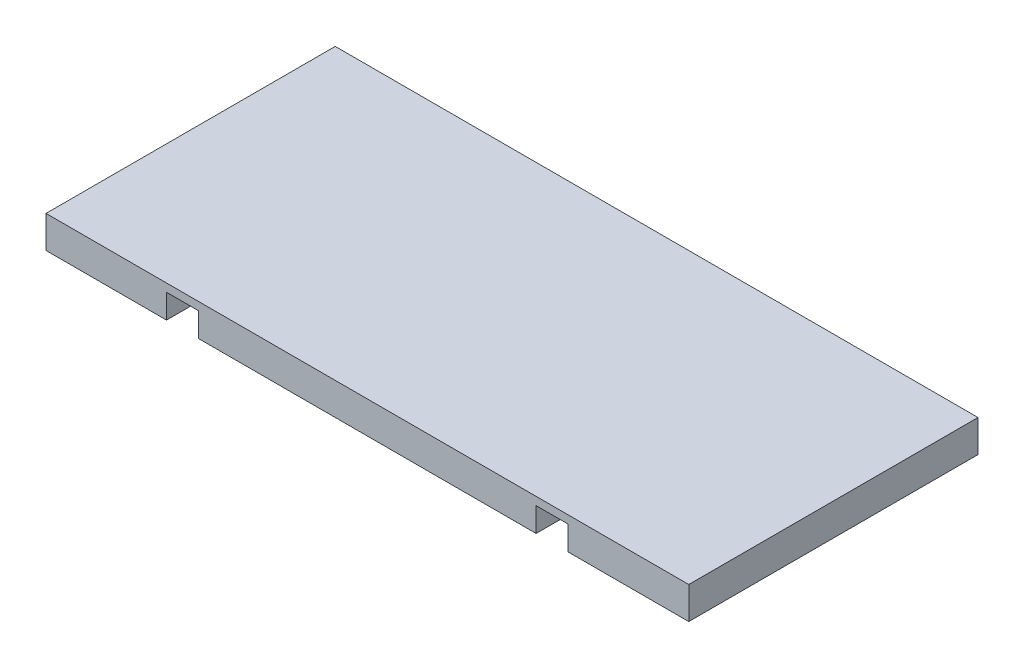
ISO-10303-21;
HEADER;
FILE_DESCRIPTION(('STEP AP214'),'2;1');
FILE_NAME('part.step','',(''),(''),'','','');
FILE_SCHEMA(('AUTOMOTIVE_DESIGN { 1 0 10303 214 1 1 1 1 }'));
ENDSEC;
DATA;
#1=APPLICATION_CONTEXT('core data for automotive mechanical design processes');
#2=APPLICATION_PROTOCOL_DEFINITION('international standard','automotive_design',2000,#1);
#3=PRODUCT_CONTEXT('',#1,'mechanical');
#4=PRODUCT('Part','Part','',(#3));
#5=PRODUCT_RELATED_PRODUCT_CATEGORY('part','',(#4));
#6=PRODUCT_DEFINITION_FORMATION('','',#4);
#7=PRODUCT_DEFINITION_CONTEXT('part definition',#1,'design');
#8=PRODUCT_DEFINITION('design','',#6,#7);
#9=PRODUCT_DEFINITION_SHAPE('','',#8);
#10=(LENGTH_UNIT() NAMED_UNIT(*) SI_UNIT(.MILLI.,.METRE.));
#11=(NAMED_UNIT(*) PLANE_ANGLE_UNIT() SI_UNIT($,.RADIAN.));
#12=(NAMED_UNIT(*) SI_UNIT($,.STERADIAN.) SOLID_ANGLE_UNIT());
#13=UNCERTAINTY_MEASURE_WITH_UNIT(LENGTH_MEASURE(1.E-05),#10,'distance_accuracy_value','');
#14=(GEOMETRIC_REPRESENTATION_CONTEXT(3) GLOBAL_UNCERTAINTY_ASSIGNED_CONTEXT((#13)) GLOBAL_UNIT_ASSIGNED_CONTEXT((#10,
#11,#12)) REPRESENTATION_CONTEXT('',''));
#15=CARTESIAN_POINT('',(0.,0.,0.));
#16=DIRECTION('',(0.,0.,1.));
#17=DIRECTION('',(1.,0.,0.));
#18=AXIS2_PLACEMENT_3D('',#15,#16,#17);
#19=CARTESIAN_POINT('',(-20.,-2.,18.));
#20=DIRECTION('',(1.,0.,0.));
#21=DIRECTION('',(0.,0.,-1.));
#22=AXIS2_PLACEMENT_3D('',#19,#20,#21);
#23=PLANE('',#22);
#24=DIRECTION('',(0.,-1.,0.));
#25=VECTOR('',#24,1.);
#26=CARTESIAN_POINT('',(-20.,-2.,0.));
#27=LINE('',#26,#25);
#28=CARTESIAN_POINT('',(-20.,0.,0.));
#29=VERTEX_POINT('',#28);
#30=CARTESIAN_POINT('',(-20.,-2.,0.));
#31=VERTEX_POINT('',#30);
#32=EDGE_CURVE('E157',#29,#31,#27,.T.);
#33=ORIENTED_EDGE('',*,*,#32,.T.);
#34=DIRECTION('',(0.,0.,-1.));
#35=VECTOR('',#34,1.);
#36=CARTESIAN_POINT('',(-20.,-2.,18.));
#37=LINE('',#36,#35);
#38=CARTESIAN_POINT('',(-20.,-2.,18.));
#39=VERTEX_POINT('',#38);
#40=EDGE_CURVE('E11',#39,#31,#37,.T.);
#41=ORIENTED_EDGE('',*,*,#40,.F.);
#42=DIRECTION('',(0.,-1.,0.));
#43=VECTOR('',#42,1.);
#44=CARTESIAN_POINT('',(-20.,-2.,18.));
#45=LINE('',#44,#43);
#46=CARTESIAN_POINT('',(-20.,0.,18.));
#47=VERTEX_POINT('',#46);
#48=EDGE_CURVE('E179',#47,#39,#45,.T.);
#49=ORIENTED_EDGE('',*,*,#48,.F.);
#50=DIRECTION('',(0.,0.,-1.));
#51=VECTOR('',#50,1.);
#52=CARTESIAN_POINT('',(-20.,0.,18.));
#53=LINE('',#52,#51);
#54=EDGE_CURVE('E153',#47,#29,#53,.T.);
#55=ORIENTED_EDGE('',*,*,#54,.T.);
#56=EDGE_LOOP('',(#33,#41,#49,#55));
#57=FACE_BOUND('',#56,.T.);
#58=ADVANCED_FACE('F37',(#57),#23,.F.);
#59=CARTESIAN_POINT('',(-20.,-2.,18.));
#60=DIRECTION('',(0.,1.,0.));
#61=DIRECTION('',(0.,0.,1.));
#62=AXIS2_PLACEMENT_3D('',#59,#60,#61);
#63=PLANE('',#62);
#64=DIRECTION('',(1.,0.,0.));
#65=VECTOR('',#64,1.);
#66=CARTESIAN_POINT('',(-20.,-2.,0.));
#67=LINE('',#66,#65);
#68=CARTESIAN_POINT('',(-12.5,-2.,0.));
#69=VERTEX_POINT('',#68);
#70=EDGE_CURVE('E160',#31,#69,#67,.T.);
#71=ORIENTED_EDGE('',*,*,#70,.T.);
#72=DIRECTION('',(0.,0.,-1.));
#73=VECTOR('',#72,1.);
#74=CARTESIAN_POINT('',(-12.5,-2.,18.));
#75=LINE('',#74,#73);
#76=CARTESIAN_POINT('',(-12.5,-2.,18.));
#77=VERTEX_POINT('',#76);
#78=EDGE_CURVE('E45',#77,#69,#75,.T.);
#79=ORIENTED_EDGE('',*,*,#78,.F.);
#80=DIRECTION('',(1.,0.,0.));
#81=VECTOR('',#80,1.);
#82=CARTESIAN_POINT('',(-20.,-2.,18.));
#83=LINE('',#82,#81);
#84=EDGE_CURVE('E108',#39,#77,#83,.T.);
#85=ORIENTED_EDGE('',*,*,#84,.F.);
#86=ORIENTED_EDGE('',*,*,#40,.T.);
#87=EDGE_LOOP('',(#71,#79,#85,#86));
#88=FACE_BOUND('',#87,.T.);
#89=ADVANCED_FACE('F257',(#88),#63,.F.);
#90=CARTESIAN_POINT('',(-12.5,-2.,18.));
#91=DIRECTION('',(-1.,0.,0.));
#92=DIRECTION('',(0.,0.,1.));
#93=AXIS2_PLACEMENT_3D('',#90,#91,#92);
#94=PLANE('',#93);
#95=DIRECTION('',(0.,1.,0.));
#96=VECTOR('',#95,1.);
#97=CARTESIAN_POINT('',(-12.5,-2.,0.));
#98=LINE('',#97,#96);
#99=CARTESIAN_POINT('',(-12.5,-0.5,0.));
#100=VERTEX_POINT('',#99);
#101=EDGE_CURVE('E162',#69,#100,#98,.T.);
#102=ORIENTED_EDGE('',*,*,#101,.T.);
#103=DIRECTION('',(0.,0.,-1.));
#104=VECTOR('',#103,1.);
#105=CARTESIAN_POINT('',(-12.5,-0.5,18.));
#106=LINE('',#105,#104);
#107=CARTESIAN_POINT('',(-12.5,-0.5,18.));
#108=VERTEX_POINT('',#107);
#109=EDGE_CURVE('E198',#108,#100,#106,.T.);
#110=ORIENTED_EDGE('',*,*,#109,.F.);
#111=DIRECTION('',(0.,1.,0.));
#112=VECTOR('',#111,1.);
#113=CARTESIAN_POINT('',(-12.5,-2.,18.));
#114=LINE('',#113,#112);
#115=EDGE_CURVE('E206',#77,#108,#114,.T.);
#116=ORIENTED_EDGE('',*,*,#115,.F.);
#117=ORIENTED_EDGE('',*,*,#78,.T.);
#118=EDGE_LOOP('',(#102,#110,#116,#117));
#119=FACE_BOUND('',#118,.T.);
#120=ADVANCED_FACE('F204',(#119),#94,.F.);
#121=CARTESIAN_POINT('',(-12.5,-0.5,18.));
#122=DIRECTION('',(0.,1.,0.));
#123=DIRECTION('',(0.,0.,1.));
#124=AXIS2_PLACEMENT_3D('',#121,#122,#123);
#125=PLANE('',#124);
#126=DIRECTION('',(1.,0.,0.));
#127=VECTOR('',#126,1.);
#128=CARTESIAN_POINT('',(-12.5,-0.5,0.));
#129=LINE('',#128,#127);
#130=CARTESIAN_POINT('',(-10.5,-0.5,0.));
#131=VERTEX_POINT('',#130);
#132=EDGE_CURVE('E164',#100,#131,#129,.T.);
#133=ORIENTED_EDGE('',*,*,#132,.T.);
#134=DIRECTION('',(0.,0.,-1.));
#135=VECTOR('',#134,1.);
#136=CARTESIAN_POINT('',(-10.5,-0.5,18.));
#137=LINE('',#136,#135);
#138=CARTESIAN_POINT('',(-10.5,-0.5,18.));
#139=VERTEX_POINT('',#138);
#140=EDGE_CURVE('E195',#139,#131,#137,.T.);
#141=ORIENTED_EDGE('',*,*,#140,.F.);
#142=DIRECTION('',(1.,0.,0.));
#143=VECTOR('',#142,1.);
#144=CARTESIAN_POINT('',(-12.5,-0.5,18.));
#145=LINE('',#144,#143);
#146=EDGE_CURVE('E224',#108,#139,#145,.T.);
#147=ORIENTED_EDGE('',*,*,#146,.F.);
#148=ORIENTED_EDGE('',*,*,#109,.T.);
#149=EDGE_LOOP('',(#133,#141,#147,#148));
#150=FACE_BOUND('',#149,.T.);
#151=ADVANCED_FACE('F215',(#150),#125,.F.);
#152=CARTESIAN_POINT('',(-10.5,-2.,18.));
#153=DIRECTION('',(1.,0.,0.));
#154=DIRECTION('',(0.,0.,-1.));
#155=AXIS2_PLACEMENT_3D('',#152,#153,#154);
#156=PLANE('',#155);
#157=DIRECTION('',(0.,-1.,0.));
#158=VECTOR('',#157,1.);
#159=CARTESIAN_POINT('',(-10.5,-2.,0.));
#160=LINE('',#159,#158);
#161=CARTESIAN_POINT('',(-10.5,-2.,0.));
#162=VERTEX_POINT('',#161);
#163=EDGE_CURVE('E166',#131,#162,#160,.T.);
#164=ORIENTED_EDGE('',*,*,#163,.T.);
#165=DIRECTION('',(0.,0.,-1.));
#166=VECTOR('',#165,1.);
#167=CARTESIAN_POINT('',(-10.5,-2.,18.));
#168=LINE('',#167,#166);
#169=CARTESIAN_POINT('',(-10.5,-2.,18.));
#170=VERTEX_POINT('',#169);
#171=EDGE_CURVE('E192',#170,#162,#168,.T.);
#172=ORIENTED_EDGE('',*,*,#171,.F.);
#173=DIRECTION('',(0.,-1.,0.));
#174=VECTOR('',#173,1.);
#175=CARTESIAN_POINT('',(-10.5,-2.,18.));
#176=LINE('',#175,#174);
#177=EDGE_CURVE('E221',#139,#170,#176,.T.);
#178=ORIENTED_EDGE('',*,*,#177,.F.);
#179=ORIENTED_EDGE('',*,*,#140,.T.);
#180=EDGE_LOOP('',(#164,#172,#178,#179));
#181=FACE_BOUND('',#180,.T.);
#182=ADVANCED_FACE('F219',(#181),#156,.F.);
#183=CARTESIAN_POINT('',(-10.5,-2.,18.));
#184=DIRECTION('',(0.,1.,0.));
#185=DIRECTION('',(0.,0.,1.));
#186=AXIS2_PLACEMENT_3D('',#183,#184,#185);
#187=PLANE('',#186);
#188=DIRECTION('',(1.,0.,0.));
#189=VECTOR('',#188,1.);
#190=CARTESIAN_POINT('',(-10.5,-2.,0.));
#191=LINE('',#190,#189);
#192=CARTESIAN_POINT('',(10.5,-2.,0.));
#193=VERTEX_POINT('',#192);
#194=EDGE_CURVE('E168',#162,#193,#191,.T.);
#195=ORIENTED_EDGE('',*,*,#194,.T.);
#196=DIRECTION('',(0.,0.,-1.));
#197=VECTOR('',#196,1.);
#198=CARTESIAN_POINT('',(10.5,-2.,18.));
#199=LINE('',#198,#197);
#200=CARTESIAN_POINT('',(10.5,-2.,18.));
#201=VERTEX_POINT('',#200);
#202=EDGE_CURVE('E189',#201,#193,#199,.T.);
#203=ORIENTED_EDGE('',*,*,#202,.F.);
#204=DIRECTION('',(1.,0.,0.));
#205=VECTOR('',#204,1.);
#206=CARTESIAN_POINT('',(-10.5,-2.,18.));
#207=LINE('',#206,#205);
#208=EDGE_CURVE('E223',#170,#201,#207,.T.);
#209=ORIENTED_EDGE('',*,*,#208,.F.);
#210=ORIENTED_EDGE('',*,*,#171,.T.);
#211=EDGE_LOOP('',(#195,#203,#209,#210));
#212=FACE_BOUND('',#211,.T.);
#213=ADVANCED_FACE('F270',(#212),#187,.F.);
#214=CARTESIAN_POINT('',(10.5,-2.,18.));
#215=DIRECTION('',(-1.,0.,0.));
#216=DIRECTION('',(0.,0.,1.));
#217=AXIS2_PLACEMENT_3D('',#214,#215,#216);
#218=PLANE('',#217);
#219=DIRECTION('',(0.,1.,0.));
#220=VECTOR('',#219,1.);
#221=CARTESIAN_POINT('',(10.5,-2.,0.));
#222=LINE('',#221,#220);
#223=CARTESIAN_POINT('',(10.5,-0.5,0.));
#224=VERTEX_POINT('',#223);
#225=EDGE_CURVE('E170',#193,#224,#222,.T.);
#226=ORIENTED_EDGE('',*,*,#225,.T.);
#227=DIRECTION('',(0.,0.,-1.));
#228=VECTOR('',#227,1.);
#229=CARTESIAN_POINT('',(10.5,-0.5,18.));
#230=LINE('',#229,#228);
#231=CARTESIAN_POINT('',(10.5,-0.5,18.));
#232=VERTEX_POINT('',#231);
#233=EDGE_CURVE('E186',#232,#224,#230,.T.);
#234=ORIENTED_EDGE('',*,*,#233,.F.);
#235=DIRECTION('',(0.,1.,0.));
#236=VECTOR('',#235,1.);
#237=CARTESIAN_POINT('',(10.5,-2.,18.));
#238=LINE('',#237,#236);
#239=EDGE_CURVE('E226',#201,#232,#238,.T.);
#240=ORIENTED_EDGE('',*,*,#239,.F.);
#241=ORIENTED_EDGE('',*,*,#202,.T.);
#242=EDGE_LOOP('',(#226,#234,#240,#241));
#243=FACE_BOUND('',#242,.T.);
#244=ADVANCED_FACE('F273',(#243),#218,.F.);
#245=CARTESIAN_POINT('',(12.5,-0.5,18.));
#246=DIRECTION('',(0.,1.,0.));
#247=DIRECTION('',(0.,0.,1.));
#248=AXIS2_PLACEMENT_3D('',#245,#246,#247);
#249=PLANE('',#248);
#250=DIRECTION('',(1.,0.,0.));
#251=VECTOR('',#250,1.);
#252=CARTESIAN_POINT('',(12.5,-0.5,0.));
#253=LINE('',#252,#251);
#254=CARTESIAN_POINT('',(12.5,-0.5,0.));
#255=VERTEX_POINT('',#254);
#256=EDGE_CURVE('E172',#224,#255,#253,.T.);
#257=ORIENTED_EDGE('',*,*,#256,.T.);
#258=DIRECTION('',(0.,0.,-1.));
#259=VECTOR('',#258,1.);
#260=CARTESIAN_POINT('',(12.5,-0.5,18.));
#261=LINE('',#260,#259);
#262=CARTESIAN_POINT('',(12.5,-0.5,18.));
#263=VERTEX_POINT('',#262);
#264=EDGE_CURVE('E183',#263,#255,#261,.T.);
#265=ORIENTED_EDGE('',*,*,#264,.F.);
#266=DIRECTION('',(1.,0.,0.));
#267=VECTOR('',#266,1.);
#268=CARTESIAN_POINT('',(12.5,-0.5,18.));
#269=LINE('',#268,#267);
#270=EDGE_CURVE('E232',#232,#263,#269,.T.);
#271=ORIENTED_EDGE('',*,*,#270,.F.);
#272=ORIENTED_EDGE('',*,*,#233,.T.);
#273=EDGE_LOOP('',(#257,#265,#271,#272));
#274=FACE_BOUND('',#273,.T.);
#275=ADVANCED_FACE('F238',(#274),#249,.F.);
#276=CARTESIAN_POINT('',(12.5,-2.,18.));
#277=DIRECTION('',(1.,0.,0.));
#278=DIRECTION('',(0.,0.,-1.));
#279=AXIS2_PLACEMENT_3D('',#276,#277,#278);
#280=PLANE('',#279);
#281=DIRECTION('',(0.,-1.,0.));
#282=VECTOR('',#281,1.);
#283=CARTESIAN_POINT('',(12.5,-2.,0.));
#284=LINE('',#283,#282);
#285=CARTESIAN_POINT('',(12.5,-2.,0.));
#286=VERTEX_POINT('',#285);
#287=EDGE_CURVE('E174',#255,#286,#284,.T.);
#288=ORIENTED_EDGE('',*,*,#287,.T.);
#289=DIRECTION('',(0.,0.,-1.));
#290=VECTOR('',#289,1.);
#291=CARTESIAN_POINT('',(12.5,-2.,18.));
#292=LINE('',#291,#290);
#293=CARTESIAN_POINT('',(12.5,-2.,18.));
#294=VERTEX_POINT('',#293);
#295=EDGE_CURVE('E148',#294,#286,#292,.T.);
#296=ORIENTED_EDGE('',*,*,#295,.F.);
#297=DIRECTION('',(0.,-1.,0.));
#298=VECTOR('',#297,1.);
#299=CARTESIAN_POINT('',(12.5,-2.,18.));
#300=LINE('',#299,#298);
#301=EDGE_CURVE('E139',#263,#294,#300,.T.);
#302=ORIENTED_EDGE('',*,*,#301,.F.);
#303=ORIENTED_EDGE('',*,*,#264,.T.);
#304=EDGE_LOOP('',(#288,#296,#302,#303));
#305=FACE_BOUND('',#304,.T.);
#306=ADVANCED_FACE('F242',(#305),#280,.F.);
#307=CARTESIAN_POINT('',(12.5,-2.,18.));
#308=DIRECTION('',(0.,1.,0.));
#309=DIRECTION('',(-1.,0.,0.));
#310=AXIS2_PLACEMENT_3D('',#307,#308,#309);
#311=PLANE('',#310);
#312=DIRECTION('',(1.,0.,0.));
#313=VECTOR('',#312,1.);
#314=CARTESIAN_POINT('',(12.5,-2.,0.));
#315=LINE('',#314,#313);
#316=CARTESIAN_POINT('',(20.,-1.99999999999999,0.));
#317=VERTEX_POINT('',#316);
#318=EDGE_CURVE('E147',#286,#317,#315,.T.);
#319=ORIENTED_EDGE('',*,*,#318,.T.);
#320=DIRECTION('',(0.,0.,-1.));
#321=VECTOR('',#320,1.);
#322=CARTESIAN_POINT('',(20.,-1.99999999999999,18.));
#323=LINE('',#322,#321);
#324=CARTESIAN_POINT('',(20.,-1.99999999999999,18.));
#325=VERTEX_POINT('',#324);
#326=EDGE_CURVE('E144',#325,#317,#323,.T.);
#327=ORIENTED_EDGE('',*,*,#326,.F.);
#328=DIRECTION('',(1.,0.,0.));
#329=VECTOR('',#328,1.);
#330=CARTESIAN_POINT('',(12.5,-2.,18.));
#331=LINE('',#330,#329);
#332=EDGE_CURVE('E133',#294,#325,#331,.T.);
#333=ORIENTED_EDGE('',*,*,#332,.F.);
#334=ORIENTED_EDGE('',*,*,#295,.T.);
#335=EDGE_LOOP('',(#319,#327,#333,#334));
#336=FACE_BOUND('',#335,.T.);
#337=ADVANCED_FACE('F145',(#336),#311,.F.);
#338=CARTESIAN_POINT('',(20.,-1.99999999999999,18.));
#339=DIRECTION('',(-1.,0.,0.));
#340=DIRECTION('',(0.,0.,1.));
#341=AXIS2_PLACEMENT_3D('',#338,#339,#340);
#342=PLANE('',#341);
#343=DIRECTION('',(0.,1.,0.));
#344=VECTOR('',#343,1.);
#345=CARTESIAN_POINT('',(20.,-1.99999999999999,0.));
#346=LINE('',#345,#344);
#347=CARTESIAN_POINT('',(20.,0.,0.));
#348=VERTEX_POINT('',#347);
#349=EDGE_CURVE('E94',#317,#348,#346,.T.);
#350=ORIENTED_EDGE('',*,*,#349,.T.);
#351=DIRECTION('',(0.,0.,-1.));
#352=VECTOR('',#351,1.);
#353=CARTESIAN_POINT('',(20.,0.,18.));
#354=LINE('',#353,#352);
#355=CARTESIAN_POINT('',(20.,0.,18.));
#356=VERTEX_POINT('',#355);
#357=EDGE_CURVE('E149',#356,#348,#354,.T.);
#358=ORIENTED_EDGE('',*,*,#357,.F.);
#359=DIRECTION('',(0.,1.,0.));
#360=VECTOR('',#359,1.);
#361=CARTESIAN_POINT('',(20.,-1.99999999999999,18.));
#362=LINE('',#361,#360);
#363=EDGE_CURVE('E137',#325,#356,#362,.T.);
#364=ORIENTED_EDGE('',*,*,#363,.F.);
#365=ORIENTED_EDGE('',*,*,#326,.T.);
#366=EDGE_LOOP('',(#350,#358,#364,#365));
#367=FACE_BOUND('',#366,.T.);
#368=ADVANCED_FACE('F151',(#367),#342,.F.);
#369=CARTESIAN_POINT('',(-20.,0.,18.));
#370=DIRECTION('',(0.,-1.,0.));
#371=DIRECTION('',(1.,0.,0.));
#372=AXIS2_PLACEMENT_3D('',#369,#370,#371);
#373=PLANE('',#372);
#374=DIRECTION('',(-1.,0.,0.));
#375=VECTOR('',#374,1.);
#376=CARTESIAN_POINT('',(-20.,0.,0.));
#377=LINE('',#376,#375);
#378=EDGE_CURVE('E100',#348,#29,#377,.T.);
#379=ORIENTED_EDGE('',*,*,#378,.T.);
#380=ORIENTED_EDGE('',*,*,#54,.F.);
#381=DIRECTION('',(-1.,0.,0.));
#382=VECTOR('',#381,1.);
#383=CARTESIAN_POINT('',(-20.,0.,18.));
#384=LINE('',#383,#382);
#385=EDGE_CURVE('E53',#356,#47,#384,.T.);
#386=ORIENTED_EDGE('',*,*,#385,.F.);
#387=ORIENTED_EDGE('',*,*,#357,.T.);
#388=EDGE_LOOP('',(#379,#380,#386,#387));
#389=FACE_BOUND('',#388,.T.);
#390=ADVANCED_FACE('F246',(#389),#373,.F.);
#391=CARTESIAN_POINT('',(0.,0.,18.));
#392=DIRECTION('',(0.,0.,-1.));
#393=DIRECTION('',(-1.,0.,0.));
#394=AXIS2_PLACEMENT_3D('',#391,#392,#393);
#395=PLANE('',#394);
#396=ORIENTED_EDGE('',*,*,#48,.T.);
#397=ORIENTED_EDGE('',*,*,#84,.T.);
#398=ORIENTED_EDGE('',*,*,#115,.T.);
#399=ORIENTED_EDGE('',*,*,#146,.T.);
#400=ORIENTED_EDGE('',*,*,#177,.T.);
#401=ORIENTED_EDGE('',*,*,#208,.T.);
#402=ORIENTED_EDGE('',*,*,#239,.T.);
#403=ORIENTED_EDGE('',*,*,#270,.T.);
#404=ORIENTED_EDGE('',*,*,#301,.T.);
#405=ORIENTED_EDGE('',*,*,#332,.T.);
#406=ORIENTED_EDGE('',*,*,#363,.T.);
#407=ORIENTED_EDGE('',*,*,#385,.T.);
#408=EDGE_LOOP('',(#396,#397,#398,#399,#400,#401,#402,#403,#404,#405,#406,#407));
#409=FACE_BOUND('',#408,.T.);
#410=ADVANCED_FACE('F135',(#409),#395,.F.);
#411=CARTESIAN_POINT('',(0.,0.,0.));
#412=DIRECTION('',(0.,0.,-1.));
#413=DIRECTION('',(-1.,0.,0.));
#414=AXIS2_PLACEMENT_3D('',#411,#412,#413);
#415=PLANE('',#414);
#416=ORIENTED_EDGE('',*,*,#32,.F.);
#417=ORIENTED_EDGE('',*,*,#378,.F.);
#418=ORIENTED_EDGE('',*,*,#349,.F.);
#419=ORIENTED_EDGE('',*,*,#318,.F.);
#420=ORIENTED_EDGE('',*,*,#287,.F.);
#421=ORIENTED_EDGE('',*,*,#256,.F.);
#422=ORIENTED_EDGE('',*,*,#225,.F.);
#423=ORIENTED_EDGE('',*,*,#194,.F.);
#424=ORIENTED_EDGE('',*,*,#163,.F.);
#425=ORIENTED_EDGE('',*,*,#132,.F.);
#426=ORIENTED_EDGE('',*,*,#101,.F.);
#427=ORIENTED_EDGE('',*,*,#70,.F.);
#428=EDGE_LOOP('',(#416,#417,#418,#419,#420,#421,#422,#423,#424,#425,#426,#427));
#429=FACE_BOUND('',#428,.T.);
#430=ADVANCED_FACE('F210',(#429),#415,.T.);
#431=CLOSED_SHELL('',(#58,#89,#120,#151,#182,#213,#244,#275,#306,#337,#368,#390,#410,#430));
#432=MANIFOLD_SOLID_BREP('B2',#431);
#433=ADVANCED_BREP_SHAPE_REPRESENTATION('',(#18,#432),#14);
#434=SHAPE_DEFINITION_REPRESENTATION(#9,#433);
ENDSEC;
END-ISO-10303-21;
